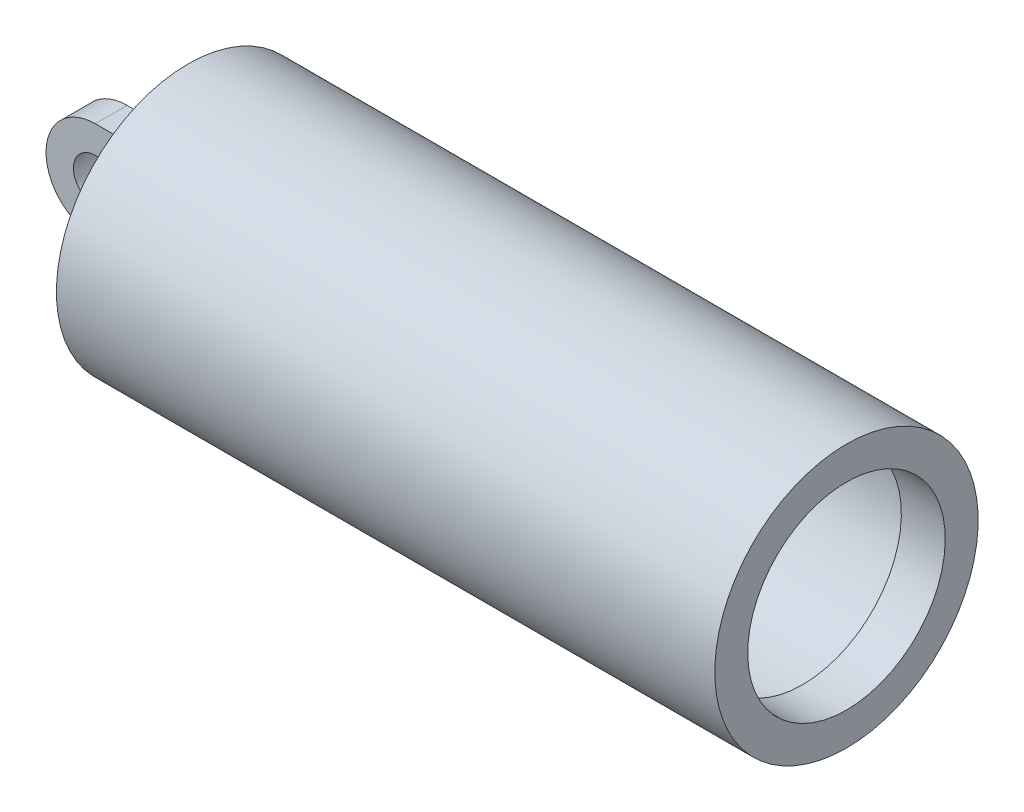
ISO-10303-21;
HEADER;
FILE_DESCRIPTION(('STEP AP214'),'2;1');
FILE_NAME('part.step','',(''),(''),'','','');
FILE_SCHEMA(('AUTOMOTIVE_DESIGN { 1 0 10303 214 1 1 1 1 }'));
ENDSEC;
DATA;
#1=APPLICATION_CONTEXT('core data for automotive mechanical design processes');
#2=APPLICATION_PROTOCOL_DEFINITION('international standard','automotive_design',2000,#1);
#3=PRODUCT_CONTEXT('',#1,'mechanical');
#4=PRODUCT('Part','Part','',(#3));
#5=PRODUCT_RELATED_PRODUCT_CATEGORY('part','',(#4));
#6=PRODUCT_DEFINITION_FORMATION('','',#4);
#7=PRODUCT_DEFINITION_CONTEXT('part definition',#1,'design');
#8=PRODUCT_DEFINITION('design','',#6,#7);
#9=PRODUCT_DEFINITION_SHAPE('','',#8);
#10=(LENGTH_UNIT() NAMED_UNIT(*) SI_UNIT(.MILLI.,.METRE.));
#11=(NAMED_UNIT(*) PLANE_ANGLE_UNIT() SI_UNIT($,.RADIAN.));
#12=(NAMED_UNIT(*) SI_UNIT($,.STERADIAN.) SOLID_ANGLE_UNIT());
#13=UNCERTAINTY_MEASURE_WITH_UNIT(LENGTH_MEASURE(1.E-05),#10,'distance_accuracy_value','');
#14=(GEOMETRIC_REPRESENTATION_CONTEXT(3) GLOBAL_UNCERTAINTY_ASSIGNED_CONTEXT((#13)) GLOBAL_UNIT_ASSIGNED_CONTEXT((#10,
#11,#12)) REPRESENTATION_CONTEXT('',''));
#15=CARTESIAN_POINT('',(0.,0.,0.));
#16=DIRECTION('',(0.,0.,1.));
#17=DIRECTION('',(1.,0.,0.));
#18=AXIS2_PLACEMENT_3D('',#15,#16,#17);
#19=CARTESIAN_POINT('',(-150.,0.,0.));
#20=DIRECTION('',(-1.,0.,0.));
#21=DIRECTION('',(0.,-1.,0.));
#22=AXIS2_PLACEMENT_3D('',#19,#20,#21);
#23=CYLINDRICAL_SURFACE('',#22,55.);
#24=CARTESIAN_POINT('',(130.,0.,0.));
#25=DIRECTION('',(-1.,0.,0.));
#26=DIRECTION('',(0.,-1.,0.));
#27=AXIS2_PLACEMENT_3D('',#24,#25,#26);
#28=CIRCLE('',#27,55.);
#29=CARTESIAN_POINT('',(130.,-55.,0.));
#30=VERTEX_POINT('',#29);
#31=EDGE_CURVE('E113',#30,#30,#28,.T.);
#32=ORIENTED_EDGE('',*,*,#31,.F.);
#33=EDGE_LOOP('',(#32));
#34=FACE_BOUND('',#33,.T.);
#35=CARTESIAN_POINT('',(-130.,0.,0.));
#36=DIRECTION('',(-1.,0.,0.));
#37=DIRECTION('',(0.,-1.,0.));
#38=AXIS2_PLACEMENT_3D('',#35,#36,#37);
#39=CIRCLE('',#38,55.);
#40=CARTESIAN_POINT('',(-130.,-55.,0.));
#41=VERTEX_POINT('',#40);
#42=EDGE_CURVE('E11',#41,#41,#39,.T.);
#43=ORIENTED_EDGE('',*,*,#42,.T.);
#44=EDGE_LOOP('',(#43));
#45=FACE_BOUND('',#44,.T.);
#46=ADVANCED_FACE('F32',(#34,#45),#23,.F.);
#47=CARTESIAN_POINT('',(-130.,0.,0.));
#48=DIRECTION('',(-1.,0.,0.));
#49=DIRECTION('',(0.,-1.,0.));
#50=AXIS2_PLACEMENT_3D('',#47,#48,#49);
#51=PLANE('',#50);
#52=ORIENTED_EDGE('',*,*,#42,.F.);
#53=EDGE_LOOP('',(#52));
#54=FACE_BOUND('',#53,.T.);
#55=ADVANCED_FACE('F158',(#54),#51,.F.);
#56=CARTESIAN_POINT('',(-150.,60.,0.));
#57=DIRECTION('',(1.,0.,0.));
#58=DIRECTION('',(0.,1.,0.));
#59=AXIS2_PLACEMENT_3D('',#56,#57,#58);
#60=PLANE('',#59);
#61=DIRECTION('',(0.,1.,0.));
#62=VECTOR('',#61,1.);
#63=CARTESIAN_POINT('',(-150.,22.5,-7.25));
#64=LINE('',#63,#62);
#65=CARTESIAN_POINT('',(-150.,-22.5,-7.25));
#66=VERTEX_POINT('',#65);
#67=CARTESIAN_POINT('',(-150.,22.5,-7.25));
#68=VERTEX_POINT('',#67);
#69=EDGE_CURVE('E81',#66,#68,#64,.T.);
#70=ORIENTED_EDGE('',*,*,#69,.T.);
#71=DIRECTION('',(0.,0.,1.));
#72=VECTOR('',#71,1.);
#73=CARTESIAN_POINT('',(-150.,22.5,-7.25));
#74=LINE('',#73,#72);
#75=CARTESIAN_POINT('',(-150.,22.5,7.25));
#76=VERTEX_POINT('',#75);
#77=EDGE_CURVE('E111',#68,#76,#74,.T.);
#78=ORIENTED_EDGE('',*,*,#77,.T.);
#79=DIRECTION('',(0.,1.,0.));
#80=VECTOR('',#79,1.);
#81=CARTESIAN_POINT('',(-150.,22.5,7.25));
#82=LINE('',#81,#80);
#83=CARTESIAN_POINT('',(-150.,-22.5,7.25));
#84=VERTEX_POINT('',#83);
#85=EDGE_CURVE('E94',#84,#76,#82,.T.);
#86=ORIENTED_EDGE('',*,*,#85,.F.);
#87=DIRECTION('',(0.,0.,1.));
#88=VECTOR('',#87,1.);
#89=CARTESIAN_POINT('',(-150.,-22.5,-7.25));
#90=LINE('',#89,#88);
#91=EDGE_CURVE('E114',#66,#84,#90,.T.);
#92=ORIENTED_EDGE('',*,*,#91,.F.);
#93=EDGE_LOOP('',(#70,#78,#86,#92));
#94=FACE_BOUND('',#93,.T.);
#95=CARTESIAN_POINT('',(-150.,0.,0.));
#96=DIRECTION('',(-1.,0.,0.));
#97=DIRECTION('',(0.,-1.,0.));
#98=AXIS2_PLACEMENT_3D('',#95,#96,#97);
#99=CIRCLE('',#98,60.);
#100=CARTESIAN_POINT('',(-150.,-60.,0.));
#101=VERTEX_POINT('',#100);
#102=EDGE_CURVE('E39',#101,#101,#99,.T.);
#103=ORIENTED_EDGE('',*,*,#102,.T.);
#104=EDGE_LOOP('',(#103));
#105=FACE_BOUND('',#104,.T.);
#106=ADVANCED_FACE('F130',(#94,#105),#60,.F.);
#107=CARTESIAN_POINT('',(-150.,0.,0.));
#108=DIRECTION('',(-1.,0.,0.));
#109=DIRECTION('',(0.,-1.,0.));
#110=AXIS2_PLACEMENT_3D('',#107,#108,#109);
#111=CYLINDRICAL_SURFACE('',#110,60.);
#112=ORIENTED_EDGE('',*,*,#102,.F.);
#113=EDGE_LOOP('',(#112));
#114=FACE_BOUND('',#113,.T.);
#115=CARTESIAN_POINT('',(150.,0.,0.));
#116=DIRECTION('',(-1.,0.,0.));
#117=DIRECTION('',(0.,-1.,0.));
#118=AXIS2_PLACEMENT_3D('',#115,#116,#117);
#119=CIRCLE('',#118,60.);
#120=CARTESIAN_POINT('',(150.,-60.,0.));
#121=VERTEX_POINT('',#120);
#122=EDGE_CURVE('E125',#121,#121,#119,.T.);
#123=ORIENTED_EDGE('',*,*,#122,.T.);
#124=EDGE_LOOP('',(#123));
#125=FACE_BOUND('',#124,.T.);
#126=ADVANCED_FACE('F132',(#114,#125),#111,.T.);
#127=CARTESIAN_POINT('',(150.,45.,0.));
#128=DIRECTION('',(-1.,0.,0.));
#129=DIRECTION('',(0.,-1.,0.));
#130=AXIS2_PLACEMENT_3D('',#127,#128,#129);
#131=PLANE('',#130);
#132=ORIENTED_EDGE('',*,*,#122,.F.);
#133=EDGE_LOOP('',(#132));
#134=FACE_BOUND('',#133,.T.);
#135=CARTESIAN_POINT('',(150.,0.,0.));
#136=DIRECTION('',(-1.,0.,0.));
#137=DIRECTION('',(0.,-1.,0.));
#138=AXIS2_PLACEMENT_3D('',#135,#136,#137);
#139=CIRCLE('',#138,45.);
#140=CARTESIAN_POINT('',(150.,-45.,0.));
#141=VERTEX_POINT('',#140);
#142=EDGE_CURVE('E122',#141,#141,#139,.T.);
#143=ORIENTED_EDGE('',*,*,#142,.T.);
#144=EDGE_LOOP('',(#143));
#145=FACE_BOUND('',#144,.T.);
#146=ADVANCED_FACE('F135',(#134,#145),#131,.F.);
#147=CARTESIAN_POINT('',(-150.,0.,0.));
#148=DIRECTION('',(-1.,0.,0.));
#149=DIRECTION('',(0.,-1.,0.));
#150=AXIS2_PLACEMENT_3D('',#147,#148,#149);
#151=CYLINDRICAL_SURFACE('',#150,45.);
#152=ORIENTED_EDGE('',*,*,#142,.F.);
#153=EDGE_LOOP('',(#152));
#154=FACE_BOUND('',#153,.T.);
#155=CARTESIAN_POINT('',(130.,0.,0.));
#156=DIRECTION('',(-1.,0.,0.));
#157=DIRECTION('',(0.,-1.,0.));
#158=AXIS2_PLACEMENT_3D('',#155,#156,#157);
#159=CIRCLE('',#158,45.);
#160=CARTESIAN_POINT('',(130.,-45.,0.));
#161=VERTEX_POINT('',#160);
#162=EDGE_CURVE('E119',#161,#161,#159,.T.);
#163=ORIENTED_EDGE('',*,*,#162,.T.);
#164=EDGE_LOOP('',(#163));
#165=FACE_BOUND('',#164,.T.);
#166=ADVANCED_FACE('F141',(#154,#165),#151,.F.);
#167=CARTESIAN_POINT('',(130.,55.,0.));
#168=DIRECTION('',(1.,0.,0.));
#169=DIRECTION('',(0.,1.,0.));
#170=AXIS2_PLACEMENT_3D('',#167,#168,#169);
#171=PLANE('',#170);
#172=ORIENTED_EDGE('',*,*,#162,.F.);
#173=EDGE_LOOP('',(#172));
#174=FACE_BOUND('',#173,.T.);
#175=ORIENTED_EDGE('',*,*,#31,.T.);
#176=EDGE_LOOP('',(#175));
#177=FACE_BOUND('',#176,.T.);
#178=ADVANCED_FACE('F147',(#174,#177),#171,.F.);
#179=CARTESIAN_POINT('',(-150.,22.5,-7.25));
#180=DIRECTION('',(0.,1.,0.));
#181=DIRECTION('',(-1.,0.,0.));
#182=AXIS2_PLACEMENT_3D('',#179,#180,#181);
#183=PLANE('',#182);
#184=DIRECTION('',(0.,0.,1.));
#185=VECTOR('',#184,1.);
#186=CARTESIAN_POINT('',(-185.,22.5,-7.25));
#187=LINE('',#186,#185);
#188=CARTESIAN_POINT('',(-185.,22.5,-7.25));
#189=VERTEX_POINT('',#188);
#190=CARTESIAN_POINT('',(-185.,22.5,7.25));
#191=VERTEX_POINT('',#190);
#192=EDGE_CURVE('E72',#189,#191,#187,.T.);
#193=ORIENTED_EDGE('',*,*,#192,.T.);
#194=DIRECTION('',(-1.,0.,0.));
#195=VECTOR('',#194,1.);
#196=CARTESIAN_POINT('',(-150.,22.5,7.25));
#197=LINE('',#196,#195);
#198=EDGE_CURVE('E76',#76,#191,#197,.T.);
#199=ORIENTED_EDGE('',*,*,#198,.F.);
#200=ORIENTED_EDGE('',*,*,#77,.F.);
#201=DIRECTION('',(-1.,0.,0.));
#202=VECTOR('',#201,1.);
#203=CARTESIAN_POINT('',(-150.,22.5,-7.25));
#204=LINE('',#203,#202);
#205=EDGE_CURVE('E46',#68,#189,#204,.T.);
#206=ORIENTED_EDGE('',*,*,#205,.T.);
#207=EDGE_LOOP('',(#193,#199,#200,#206));
#208=FACE_BOUND('',#207,.T.);
#209=ADVANCED_FACE('F74',(#208),#183,.T.);
#210=CARTESIAN_POINT('',(-150.,-22.5,-7.25));
#211=DIRECTION('',(0.,-1.,0.));
#212=DIRECTION('',(1.,0.,0.));
#213=AXIS2_PLACEMENT_3D('',#210,#211,#212);
#214=PLANE('',#213);
#215=ORIENTED_EDGE('',*,*,#91,.T.);
#216=DIRECTION('',(1.,0.,0.));
#217=VECTOR('',#216,1.);
#218=CARTESIAN_POINT('',(-150.,-22.5,7.25));
#219=LINE('',#218,#217);
#220=CARTESIAN_POINT('',(-185.,-22.5,7.25));
#221=VERTEX_POINT('',#220);
#222=EDGE_CURVE('E89',#221,#84,#219,.T.);
#223=ORIENTED_EDGE('',*,*,#222,.F.);
#224=DIRECTION('',(0.,0.,1.));
#225=VECTOR('',#224,1.);
#226=CARTESIAN_POINT('',(-185.,-22.5,-7.25));
#227=LINE('',#226,#225);
#228=CARTESIAN_POINT('',(-185.,-22.5,-7.25));
#229=VERTEX_POINT('',#228);
#230=EDGE_CURVE('E80',#229,#221,#227,.T.);
#231=ORIENTED_EDGE('',*,*,#230,.F.);
#232=DIRECTION('',(1.,0.,0.));
#233=VECTOR('',#232,1.);
#234=CARTESIAN_POINT('',(-150.,-22.5,-7.25));
#235=LINE('',#234,#233);
#236=EDGE_CURVE('E54',#229,#66,#235,.T.);
#237=ORIENTED_EDGE('',*,*,#236,.T.);
#238=EDGE_LOOP('',(#215,#223,#231,#237));
#239=FACE_BOUND('',#238,.T.);
#240=ADVANCED_FACE('F170',(#239),#214,.T.);
#241=CARTESIAN_POINT('',(-185.,0.,-7.25));
#242=DIRECTION('',(0.,0.,1.));
#243=DIRECTION('',(1.,0.,0.));
#244=AXIS2_PLACEMENT_3D('',#241,#242,#243);
#245=CYLINDRICAL_SURFACE('',#244,22.5);
#246=ORIENTED_EDGE('',*,*,#230,.T.);
#247=CARTESIAN_POINT('',(-185.,0.,7.25));
#248=DIRECTION('',(0.,0.,1.));
#249=DIRECTION('',(1.,0.,0.));
#250=AXIS2_PLACEMENT_3D('',#247,#248,#249);
#251=CIRCLE('',#250,22.5);
#252=EDGE_CURVE('E84',#191,#221,#251,.T.);
#253=ORIENTED_EDGE('',*,*,#252,.F.);
#254=ORIENTED_EDGE('',*,*,#192,.F.);
#255=CARTESIAN_POINT('',(-185.,0.,-7.25));
#256=DIRECTION('',(0.,0.,1.));
#257=DIRECTION('',(1.,0.,0.));
#258=AXIS2_PLACEMENT_3D('',#255,#256,#257);
#259=CIRCLE('',#258,22.5);
#260=EDGE_CURVE('E106',#189,#229,#259,.T.);
#261=ORIENTED_EDGE('',*,*,#260,.T.);
#262=EDGE_LOOP('',(#246,#253,#254,#261));
#263=FACE_BOUND('',#262,.T.);
#264=ADVANCED_FACE('F85',(#263),#245,.T.);
#265=CARTESIAN_POINT('',(-185.,0.,-7.25));
#266=DIRECTION('',(0.,0.,1.));
#267=DIRECTION('',(1.,0.,0.));
#268=AXIS2_PLACEMENT_3D('',#265,#266,#267);
#269=PLANE('',#268);
#270=CARTESIAN_POINT('',(-185.,0.,-7.25));
#271=DIRECTION('',(0.,0.,1.));
#272=DIRECTION('',(1.,0.,0.));
#273=AXIS2_PLACEMENT_3D('',#270,#271,#272);
#274=CIRCLE('',#273,10.);
#275=CARTESIAN_POINT('',(-175.,0.,-7.25));
#276=VERTEX_POINT('',#275);
#277=EDGE_CURVE('E102',#276,#276,#274,.T.);
#278=ORIENTED_EDGE('',*,*,#277,.T.);
#279=EDGE_LOOP('',(#278));
#280=FACE_BOUND('',#279,.T.);
#281=ORIENTED_EDGE('',*,*,#205,.F.);
#282=ORIENTED_EDGE('',*,*,#69,.F.);
#283=ORIENTED_EDGE('',*,*,#236,.F.);
#284=ORIENTED_EDGE('',*,*,#260,.F.);
#285=EDGE_LOOP('',(#281,#282,#283,#284));
#286=FACE_BOUND('',#285,.T.);
#287=ADVANCED_FACE('F173',(#280,#286),#269,.F.);
#288=CARTESIAN_POINT('',(-185.,0.,-7.25));
#289=DIRECTION('',(0.,0.,1.));
#290=DIRECTION('',(1.,0.,0.));
#291=AXIS2_PLACEMENT_3D('',#288,#289,#290);
#292=CYLINDRICAL_SURFACE('',#291,10.);
#293=ORIENTED_EDGE('',*,*,#277,.F.);
#294=EDGE_LOOP('',(#293));
#295=FACE_BOUND('',#294,.T.);
#296=CARTESIAN_POINT('',(-185.,0.,7.25));
#297=DIRECTION('',(0.,0.,1.));
#298=DIRECTION('',(1.,0.,0.));
#299=AXIS2_PLACEMENT_3D('',#296,#297,#298);
#300=CIRCLE('',#299,10.);
#301=CARTESIAN_POINT('',(-175.,0.,7.25));
#302=VERTEX_POINT('',#301);
#303=EDGE_CURVE('E95',#302,#302,#300,.T.);
#304=ORIENTED_EDGE('',*,*,#303,.T.);
#305=EDGE_LOOP('',(#304));
#306=FACE_BOUND('',#305,.T.);
#307=ADVANCED_FACE('F178',(#295,#306),#292,.F.);
#308=CARTESIAN_POINT('',(-185.,0.,7.25));
#309=DIRECTION('',(0.,0.,1.));
#310=DIRECTION('',(1.,0.,0.));
#311=AXIS2_PLACEMENT_3D('',#308,#309,#310);
#312=PLANE('',#311);
#313=ORIENTED_EDGE('',*,*,#198,.T.);
#314=ORIENTED_EDGE('',*,*,#252,.T.);
#315=ORIENTED_EDGE('',*,*,#222,.T.);
#316=ORIENTED_EDGE('',*,*,#85,.T.);
#317=EDGE_LOOP('',(#313,#314,#315,#316));
#318=FACE_BOUND('',#317,.T.);
#319=ORIENTED_EDGE('',*,*,#303,.F.);
#320=EDGE_LOOP('',(#319));
#321=FACE_BOUND('',#320,.T.);
#322=ADVANCED_FACE('F91',(#318,#321),#312,.T.);
#323=CLOSED_SHELL('',(#46,#55,#106,#126,#146,#166,#178,#209,#240,#264,#287,#307,#322));
#324=MANIFOLD_SOLID_BREP('B2',#323);
#325=ADVANCED_BREP_SHAPE_REPRESENTATION('',(#18,#324),#14);
#326=SHAPE_DEFINITION_REPRESENTATION(#9,#325);
ENDSEC;
END-ISO-10303-21;
